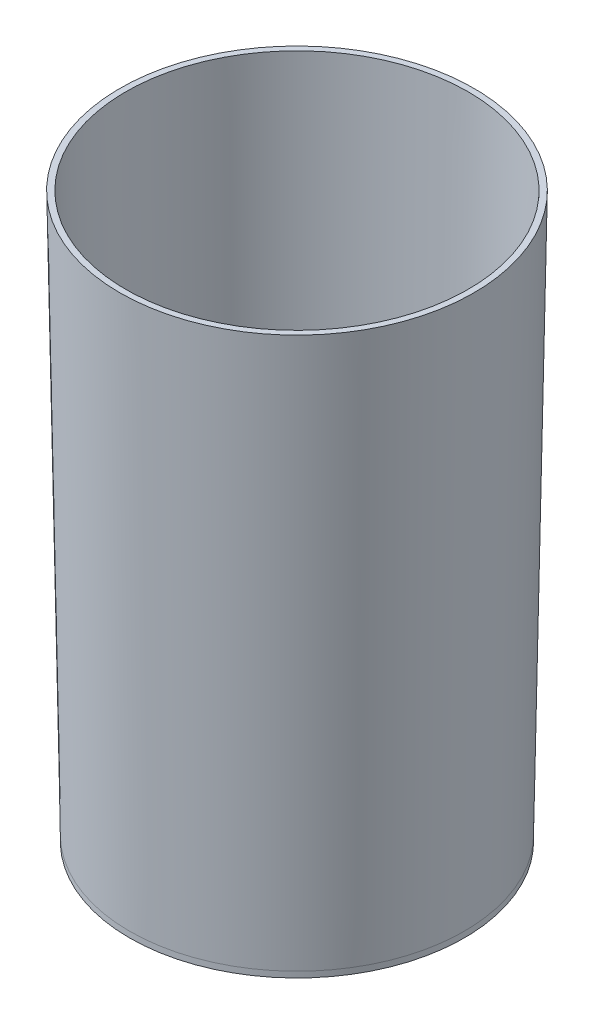
ISO-10303-21;
HEADER;
FILE_DESCRIPTION(('STEP AP214'),'2;1');
FILE_NAME('part.step','',(''),(''),'','','');
FILE_SCHEMA(('AUTOMOTIVE_DESIGN { 1 0 10303 214 1 1 1 1 }'));
ENDSEC;
DATA;
#1=APPLICATION_CONTEXT('core data for automotive mechanical design processes');
#2=APPLICATION_PROTOCOL_DEFINITION('international standard','automotive_design',2000,#1);
#3=PRODUCT_CONTEXT('',#1,'mechanical');
#4=PRODUCT('Part','Part','',(#3));
#5=PRODUCT_RELATED_PRODUCT_CATEGORY('part','',(#4));
#6=PRODUCT_DEFINITION_FORMATION('','',#4);
#7=PRODUCT_DEFINITION_CONTEXT('part definition',#1,'design');
#8=PRODUCT_DEFINITION('design','',#6,#7);
#9=PRODUCT_DEFINITION_SHAPE('','',#8);
#10=(LENGTH_UNIT() NAMED_UNIT(*) SI_UNIT(.MILLI.,.METRE.));
#11=(NAMED_UNIT(*) PLANE_ANGLE_UNIT() SI_UNIT($,.RADIAN.));
#12=(NAMED_UNIT(*) SI_UNIT($,.STERADIAN.) SOLID_ANGLE_UNIT());
#13=UNCERTAINTY_MEASURE_WITH_UNIT(LENGTH_MEASURE(1.E-05),#10,'distance_accuracy_value','');
#14=(GEOMETRIC_REPRESENTATION_CONTEXT(3) GLOBAL_UNCERTAINTY_ASSIGNED_CONTEXT((#13)) GLOBAL_UNIT_ASSIGNED_CONTEXT((#10,
#11,#12)) REPRESENTATION_CONTEXT('',''));
#15=CARTESIAN_POINT('',(0.,0.,0.));
#16=DIRECTION('',(0.,0.,1.));
#17=DIRECTION('',(1.,0.,0.));
#18=AXIS2_PLACEMENT_3D('',#15,#16,#17);
#19=CARTESIAN_POINT('',(0.,0.,0.));
#20=DIRECTION('',(0.,1.,0.));
#21=DIRECTION('',(0.,0.,1.));
#22=AXIS2_PLACEMENT_3D('',#19,#20,#21);
#23=CONICAL_SURFACE('',#22,57.15,0.0174532925199433);
#24=CARTESIAN_POINT('',(0.,190.5,0.));
#25=DIRECTION('',(0.,1.,0.));
#26=DIRECTION('',(0.,0.,1.));
#27=AXIS2_PLACEMENT_3D('',#24,#25,#26);
#28=CIRCLE('',#27,60.4751898688254);
#29=CARTESIAN_POINT('',(0.,190.5,60.4751898688254));
#30=VERTEX_POINT('',#29);
#31=EDGE_CURVE('E10',#30,#30,#28,.T.);
#32=ORIENTED_EDGE('',*,*,#31,.F.);
#33=EDGE_LOOP('',(#32));
#34=FACE_BOUND('',#33,.T.);
#35=CARTESIAN_POINT('',(0.,0.,0.));
#36=DIRECTION('',(0.,-1.,0.));
#37=DIRECTION('',(0.,0.,-1.));
#38=AXIS2_PLACEMENT_3D('',#35,#36,#37);
#39=CIRCLE('',#38,57.15);
#40=CARTESIAN_POINT('',(0.,0.,-57.15));
#41=VERTEX_POINT('',#40);
#42=EDGE_CURVE('E63',#41,#41,#39,.T.);
#43=ORIENTED_EDGE('',*,*,#42,.F.);
#44=EDGE_LOOP('',(#43));
#45=FACE_BOUND('',#44,.T.);
#46=ADVANCED_FACE('F43',(#34,#45),#23,.T.);
#47=CARTESIAN_POINT('',(0.,190.5,0.));
#48=DIRECTION('',(0.,1.,0.));
#49=DIRECTION('',(0.,0.,1.));
#50=AXIS2_PLACEMENT_3D('',#47,#48,#49);
#51=PLANE('',#50);
#52=CARTESIAN_POINT('',(0.,190.5,0.));
#53=DIRECTION('',(0.,-1.,0.));
#54=DIRECTION('',(0.,0.,-1.));
#55=AXIS2_PLACEMENT_3D('',#52,#53,#54);
#56=CIRCLE('',#55,58.4751898688255);
#57=CARTESIAN_POINT('',(0.,190.5,-58.4751898688255));
#58=VERTEX_POINT('',#57);
#59=EDGE_CURVE('E50',#58,#58,#56,.T.);
#60=ORIENTED_EDGE('',*,*,#59,.T.);
#61=EDGE_LOOP('',(#60));
#62=FACE_BOUND('',#61,.T.);
#63=ORIENTED_EDGE('',*,*,#31,.T.);
#64=EDGE_LOOP('',(#63));
#65=FACE_BOUND('',#64,.T.);
#66=ADVANCED_FACE('F81',(#62,#65),#51,.T.);
#67=CARTESIAN_POINT('',(0.,0.,0.));
#68=DIRECTION('',(0.,1.,0.));
#69=DIRECTION('',(0.,0.,-1.));
#70=AXIS2_PLACEMENT_3D('',#67,#68,#69);
#71=CONICAL_SURFACE('',#70,55.15,0.0174532925199433);
#72=ORIENTED_EDGE('',*,*,#59,.F.);
#73=EDGE_LOOP('',(#72));
#74=FACE_BOUND('',#73,.T.);
#75=CARTESIAN_POINT('',(0.,0.,0.));
#76=DIRECTION('',(0.,-1.,0.));
#77=DIRECTION('',(0.,0.,-1.));
#78=AXIS2_PLACEMENT_3D('',#75,#76,#77);
#79=CIRCLE('',#78,55.15);
#80=CARTESIAN_POINT('',(0.,0.,-55.15));
#81=VERTEX_POINT('',#80);
#82=EDGE_CURVE('E55',#81,#81,#79,.T.);
#83=ORIENTED_EDGE('',*,*,#82,.T.);
#84=EDGE_LOOP('',(#83));
#85=FACE_BOUND('',#84,.T.);
#86=ADVANCED_FACE('F86',(#74,#85),#71,.F.);
#87=CARTESIAN_POINT('',(0.,0.,0.));
#88=DIRECTION('',(0.,-1.,0.));
#89=DIRECTION('',(0.,0.,-1.));
#90=AXIS2_PLACEMENT_3D('',#87,#88,#89);
#91=PLANE('',#90);
#92=ORIENTED_EDGE('',*,*,#82,.F.);
#93=EDGE_LOOP('',(#92));
#94=FACE_BOUND('',#93,.T.);
#95=ADVANCED_FACE('F76',(#94),#91,.F.);
#96=CARTESIAN_POINT('',(0.,-2.,0.));
#97=DIRECTION('',(0.,1.,0.));
#98=DIRECTION('',(0.,0.,1.));
#99=AXIS2_PLACEMENT_3D('',#96,#97,#98);
#100=CYLINDRICAL_SURFACE('',#99,57.15);
#101=CARTESIAN_POINT('',(0.,-2.,0.));
#102=DIRECTION('',(0.,-1.,0.));
#103=DIRECTION('',(0.,0.,-1.));
#104=AXIS2_PLACEMENT_3D('',#101,#102,#103);
#105=CIRCLE('',#104,57.15);
#106=CARTESIAN_POINT('',(0.,-2.,-57.15));
#107=VERTEX_POINT('',#106);
#108=EDGE_CURVE('E60',#107,#107,#105,.T.);
#109=ORIENTED_EDGE('',*,*,#108,.F.);
#110=EDGE_LOOP('',(#109));
#111=FACE_BOUND('',#110,.T.);
#112=ORIENTED_EDGE('',*,*,#42,.T.);
#113=EDGE_LOOP('',(#112));
#114=FACE_BOUND('',#113,.T.);
#115=ADVANCED_FACE('F73',(#111,#114),#100,.T.);
#116=CARTESIAN_POINT('',(0.,-2.,0.));
#117=DIRECTION('',(0.,-1.,0.));
#118=DIRECTION('',(0.,0.,-1.));
#119=AXIS2_PLACEMENT_3D('',#116,#117,#118);
#120=PLANE('',#119);
#121=ORIENTED_EDGE('',*,*,#108,.T.);
#122=EDGE_LOOP('',(#121));
#123=FACE_BOUND('',#122,.T.);
#124=ADVANCED_FACE('F71',(#123),#120,.T.);
#125=CLOSED_SHELL('',(#46,#66,#86,#95,#115,#124));
#126=MANIFOLD_SOLID_BREP('B2',#125);
#127=ADVANCED_BREP_SHAPE_REPRESENTATION('',(#18,#126),#14);
#128=SHAPE_DEFINITION_REPRESENTATION(#9,#127);
ENDSEC;
END-ISO-10303-21;
